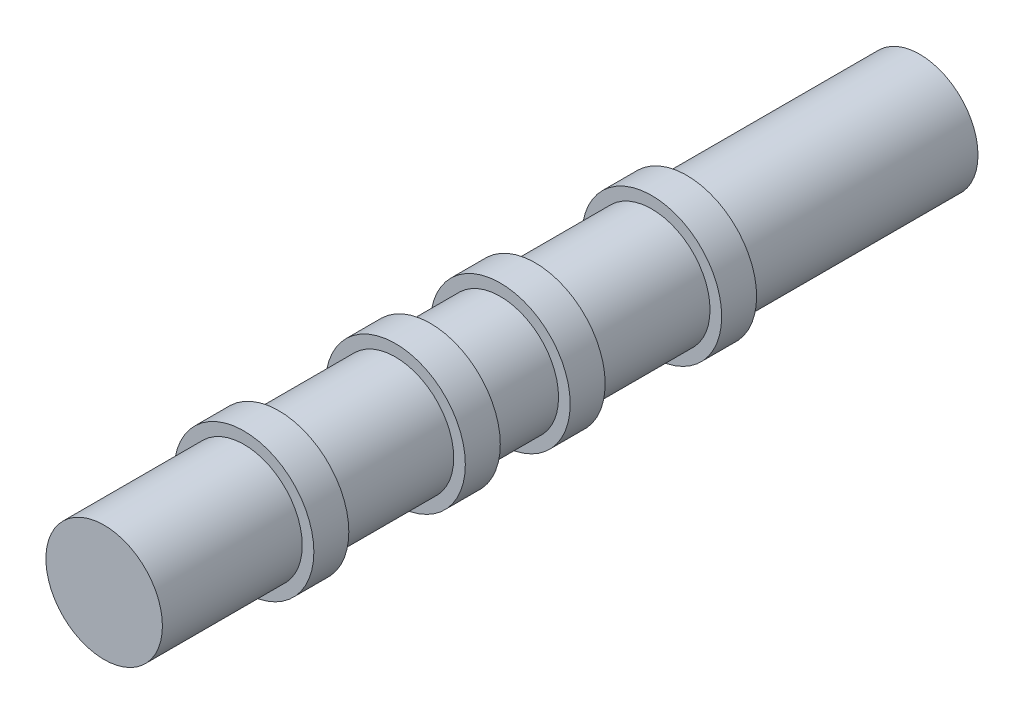
ISO-10303-21;
HEADER;
FILE_DESCRIPTION(('STEP AP214'),'2;1');
FILE_NAME('part.step','',(''),(''),'','','');
FILE_SCHEMA(('AUTOMOTIVE_DESIGN { 1 0 10303 214 1 1 1 1 }'));
ENDSEC;
DATA;
#1=APPLICATION_CONTEXT('core data for automotive mechanical design processes');
#2=APPLICATION_PROTOCOL_DEFINITION('international standard','automotive_design',2000,#1);
#3=PRODUCT_CONTEXT('',#1,'mechanical');
#4=PRODUCT('Part','Part','',(#3));
#5=PRODUCT_RELATED_PRODUCT_CATEGORY('part','',(#4));
#6=PRODUCT_DEFINITION_FORMATION('','',#4);
#7=PRODUCT_DEFINITION_CONTEXT('part definition',#1,'design');
#8=PRODUCT_DEFINITION('design','',#6,#7);
#9=PRODUCT_DEFINITION_SHAPE('','',#8);
#10=(LENGTH_UNIT() NAMED_UNIT(*) SI_UNIT(.MILLI.,.METRE.));
#11=(NAMED_UNIT(*) PLANE_ANGLE_UNIT() SI_UNIT($,.RADIAN.));
#12=(NAMED_UNIT(*) SI_UNIT($,.STERADIAN.) SOLID_ANGLE_UNIT());
#13=UNCERTAINTY_MEASURE_WITH_UNIT(LENGTH_MEASURE(1.E-05),#10,'distance_accuracy_value','');
#14=(GEOMETRIC_REPRESENTATION_CONTEXT(3) GLOBAL_UNCERTAINTY_ASSIGNED_CONTEXT((#13)) GLOBAL_UNIT_ASSIGNED_CONTEXT((#10,
#11,#12)) REPRESENTATION_CONTEXT('',''));
#15=CARTESIAN_POINT('',(0.,0.,0.));
#16=DIRECTION('',(0.,0.,1.));
#17=DIRECTION('',(1.,0.,0.));
#18=AXIS2_PLACEMENT_3D('',#15,#16,#17);
#19=CARTESIAN_POINT('',(0.,0.,20.));
#20=DIRECTION('',(0.,0.,-1.));
#21=DIRECTION('',(-1.,0.,0.));
#22=AXIS2_PLACEMENT_3D('',#19,#20,#21);
#23=CYLINDRICAL_SURFACE('',#22,5.);
#24=CARTESIAN_POINT('',(0.,0.,20.));
#25=DIRECTION('',(0.,0.,1.));
#26=DIRECTION('',(1.,0.,0.));
#27=AXIS2_PLACEMENT_3D('',#24,#25,#26);
#28=CIRCLE('',#27,5.);
#29=CARTESIAN_POINT('',(5.,0.,20.));
#30=VERTEX_POINT('',#29);
#31=EDGE_CURVE('E87',#30,#30,#28,.T.);
#32=ORIENTED_EDGE('',*,*,#31,.F.);
#33=EDGE_LOOP('',(#32));
#34=FACE_BOUND('',#33,.T.);
#35=CARTESIAN_POINT('',(0.,0.,0.));
#36=DIRECTION('',(0.,0.,1.));
#37=DIRECTION('',(1.,0.,0.));
#38=AXIS2_PLACEMENT_3D('',#35,#36,#37);
#39=CIRCLE('',#38,5.);
#40=CARTESIAN_POINT('',(5.,0.,0.));
#41=VERTEX_POINT('',#40);
#42=EDGE_CURVE('E40',#41,#41,#39,.T.);
#43=ORIENTED_EDGE('',*,*,#42,.T.);
#44=EDGE_LOOP('',(#43));
#45=FACE_BOUND('',#44,.T.);
#46=ADVANCED_FACE('F37',(#34,#45),#23,.T.);
#47=CARTESIAN_POINT('',(0.,0.,0.));
#48=DIRECTION('',(0.,0.,1.));
#49=DIRECTION('',(1.,0.,0.));
#50=AXIS2_PLACEMENT_3D('',#47,#48,#49);
#51=PLANE('',#50);
#52=ORIENTED_EDGE('',*,*,#42,.F.);
#53=EDGE_LOOP('',(#52));
#54=FACE_BOUND('',#53,.T.);
#55=ADVANCED_FACE('F99',(#54),#51,.F.);
#56=CARTESIAN_POINT('',(0.,0.,23.));
#57=DIRECTION('',(0.,0.,-1.));
#58=DIRECTION('',(-1.,0.,0.));
#59=AXIS2_PLACEMENT_3D('',#56,#57,#58);
#60=CYLINDRICAL_SURFACE('',#59,6.);
#61=CARTESIAN_POINT('',(0.,0.,23.));
#62=DIRECTION('',(0.,0.,1.));
#63=DIRECTION('',(1.,0.,0.));
#64=AXIS2_PLACEMENT_3D('',#61,#62,#63);
#65=CIRCLE('',#64,6.);
#66=CARTESIAN_POINT('',(6.,0.,23.));
#67=VERTEX_POINT('',#66);
#68=EDGE_CURVE('E88',#67,#67,#65,.T.);
#69=ORIENTED_EDGE('',*,*,#68,.F.);
#70=EDGE_LOOP('',(#69));
#71=FACE_BOUND('',#70,.T.);
#72=CARTESIAN_POINT('',(0.,0.,20.));
#73=DIRECTION('',(0.,0.,1.));
#74=DIRECTION('',(1.,0.,0.));
#75=AXIS2_PLACEMENT_3D('',#72,#73,#74);
#76=CIRCLE('',#75,6.);
#77=CARTESIAN_POINT('',(6.,0.,20.));
#78=VERTEX_POINT('',#77);
#79=EDGE_CURVE('E84',#78,#78,#76,.T.);
#80=ORIENTED_EDGE('',*,*,#79,.T.);
#81=EDGE_LOOP('',(#80));
#82=FACE_BOUND('',#81,.T.);
#83=ADVANCED_FACE('F101',(#71,#82),#60,.T.);
#84=CARTESIAN_POINT('',(0.,0.,23.));
#85=DIRECTION('',(0.,0.,1.));
#86=DIRECTION('',(1.,0.,0.));
#87=AXIS2_PLACEMENT_3D('',#84,#85,#86);
#88=PLANE('',#87);
#89=CARTESIAN_POINT('',(0.,0.,23.));
#90=DIRECTION('',(0.,0.,1.));
#91=DIRECTION('',(1.,0.,0.));
#92=AXIS2_PLACEMENT_3D('',#89,#90,#91);
#93=CIRCLE('',#92,5.);
#94=CARTESIAN_POINT('',(5.,0.,23.));
#95=VERTEX_POINT('',#94);
#96=EDGE_CURVE('E75',#95,#95,#93,.T.);
#97=ORIENTED_EDGE('',*,*,#96,.F.);
#98=EDGE_LOOP('',(#97));
#99=FACE_BOUND('',#98,.T.);
#100=ORIENTED_EDGE('',*,*,#68,.T.);
#101=EDGE_LOOP('',(#100));
#102=FACE_BOUND('',#101,.T.);
#103=ADVANCED_FACE('F106',(#99,#102),#88,.T.);
#104=CARTESIAN_POINT('',(0.,0.,20.));
#105=DIRECTION('',(0.,0.,1.));
#106=DIRECTION('',(1.,0.,0.));
#107=AXIS2_PLACEMENT_3D('',#104,#105,#106);
#108=PLANE('',#107);
#109=ORIENTED_EDGE('',*,*,#31,.T.);
#110=EDGE_LOOP('',(#109));
#111=FACE_BOUND('',#110,.T.);
#112=ORIENTED_EDGE('',*,*,#79,.F.);
#113=EDGE_LOOP('',(#112));
#114=FACE_BOUND('',#113,.T.);
#115=ADVANCED_FACE('F111',(#111,#114),#108,.F.);
#116=CARTESIAN_POINT('',(0.,0.,33.));
#117=DIRECTION('',(0.,0.,-1.));
#118=DIRECTION('',(-1.,0.,0.));
#119=AXIS2_PLACEMENT_3D('',#116,#117,#118);
#120=CYLINDRICAL_SURFACE('',#119,5.);
#121=CARTESIAN_POINT('',(0.,0.,33.));
#122=DIRECTION('',(0.,0.,1.));
#123=DIRECTION('',(1.,0.,0.));
#124=AXIS2_PLACEMENT_3D('',#121,#122,#123);
#125=CIRCLE('',#124,5.);
#126=CARTESIAN_POINT('',(5.,0.,33.));
#127=VERTEX_POINT('',#126);
#128=EDGE_CURVE('E79',#127,#127,#125,.T.);
#129=ORIENTED_EDGE('',*,*,#128,.F.);
#130=EDGE_LOOP('',(#129));
#131=FACE_BOUND('',#130,.T.);
#132=ORIENTED_EDGE('',*,*,#96,.T.);
#133=EDGE_LOOP('',(#132));
#134=FACE_BOUND('',#133,.T.);
#135=ADVANCED_FACE('F114',(#131,#134),#120,.T.);
#136=CARTESIAN_POINT('',(0.,0.,36.));
#137=DIRECTION('',(0.,0.,-1.));
#138=DIRECTION('',(-1.,0.,0.));
#139=AXIS2_PLACEMENT_3D('',#136,#137,#138);
#140=CYLINDRICAL_SURFACE('',#139,6.);
#141=CARTESIAN_POINT('',(0.,0.,36.));
#142=DIRECTION('',(0.,0.,1.));
#143=DIRECTION('',(1.,0.,0.));
#144=AXIS2_PLACEMENT_3D('',#141,#142,#143);
#145=CIRCLE('',#144,6.);
#146=CARTESIAN_POINT('',(6.,0.,36.));
#147=VERTEX_POINT('',#146);
#148=EDGE_CURVE('E76',#147,#147,#145,.T.);
#149=ORIENTED_EDGE('',*,*,#148,.F.);
#150=EDGE_LOOP('',(#149));
#151=FACE_BOUND('',#150,.T.);
#152=CARTESIAN_POINT('',(0.,0.,33.));
#153=DIRECTION('',(0.,0.,1.));
#154=DIRECTION('',(1.,0.,0.));
#155=AXIS2_PLACEMENT_3D('',#152,#153,#154);
#156=CIRCLE('',#155,6.);
#157=CARTESIAN_POINT('',(6.,0.,33.));
#158=VERTEX_POINT('',#157);
#159=EDGE_CURVE('E72',#158,#158,#156,.T.);
#160=ORIENTED_EDGE('',*,*,#159,.T.);
#161=EDGE_LOOP('',(#160));
#162=FACE_BOUND('',#161,.T.);
#163=ADVANCED_FACE('F120',(#151,#162),#140,.T.);
#164=CARTESIAN_POINT('',(0.,0.,36.));
#165=DIRECTION('',(0.,0.,1.));
#166=DIRECTION('',(1.,0.,0.));
#167=AXIS2_PLACEMENT_3D('',#164,#165,#166);
#168=PLANE('',#167);
#169=CARTESIAN_POINT('',(0.,0.,36.));
#170=DIRECTION('',(0.,0.,1.));
#171=DIRECTION('',(1.,0.,0.));
#172=AXIS2_PLACEMENT_3D('',#169,#170,#171);
#173=CIRCLE('',#172,5.);
#174=CARTESIAN_POINT('',(5.,0.,36.));
#175=VERTEX_POINT('',#174);
#176=EDGE_CURVE('E49',#175,#175,#173,.T.);
#177=ORIENTED_EDGE('',*,*,#176,.F.);
#178=EDGE_LOOP('',(#177));
#179=FACE_BOUND('',#178,.T.);
#180=ORIENTED_EDGE('',*,*,#148,.T.);
#181=EDGE_LOOP('',(#180));
#182=FACE_BOUND('',#181,.T.);
#183=ADVANCED_FACE('F124',(#179,#182),#168,.T.);
#184=CARTESIAN_POINT('',(0.,0.,33.));
#185=DIRECTION('',(0.,0.,1.));
#186=DIRECTION('',(1.,0.,0.));
#187=AXIS2_PLACEMENT_3D('',#184,#185,#186);
#188=PLANE('',#187);
#189=ORIENTED_EDGE('',*,*,#128,.T.);
#190=EDGE_LOOP('',(#189));
#191=FACE_BOUND('',#190,.T.);
#192=ORIENTED_EDGE('',*,*,#159,.F.);
#193=EDGE_LOOP('',(#192));
#194=FACE_BOUND('',#193,.T.);
#195=ADVANCED_FACE('F126',(#191,#194),#188,.F.);
#196=CARTESIAN_POINT('',(0.,0.,42.));
#197=DIRECTION('',(0.,0.,-1.));
#198=DIRECTION('',(-1.,0.,0.));
#199=AXIS2_PLACEMENT_3D('',#196,#197,#198);
#200=CYLINDRICAL_SURFACE('',#199,5.);
#201=CARTESIAN_POINT('',(0.,0.,42.));
#202=DIRECTION('',(0.,0.,1.));
#203=DIRECTION('',(1.,0.,0.));
#204=AXIS2_PLACEMENT_3D('',#201,#202,#203);
#205=CIRCLE('',#204,5.);
#206=CARTESIAN_POINT('',(5.,0.,42.));
#207=VERTEX_POINT('',#206);
#208=EDGE_CURVE('E67',#207,#207,#205,.T.);
#209=ORIENTED_EDGE('',*,*,#208,.F.);
#210=EDGE_LOOP('',(#209));
#211=FACE_BOUND('',#210,.T.);
#212=ORIENTED_EDGE('',*,*,#176,.T.);
#213=EDGE_LOOP('',(#212));
#214=FACE_BOUND('',#213,.T.);
#215=ADVANCED_FACE('F129',(#211,#214),#200,.T.);
#216=CARTESIAN_POINT('',(0.,0.,45.));
#217=DIRECTION('',(0.,0.,-1.));
#218=DIRECTION('',(-1.,0.,0.));
#219=AXIS2_PLACEMENT_3D('',#216,#217,#218);
#220=CYLINDRICAL_SURFACE('',#219,6.);
#221=CARTESIAN_POINT('',(0.,0.,45.));
#222=DIRECTION('',(0.,0.,1.));
#223=DIRECTION('',(1.,0.,0.));
#224=AXIS2_PLACEMENT_3D('',#221,#222,#223);
#225=CIRCLE('',#224,6.);
#226=CARTESIAN_POINT('',(6.,0.,45.));
#227=VERTEX_POINT('',#226);
#228=EDGE_CURVE('E64',#227,#227,#225,.T.);
#229=ORIENTED_EDGE('',*,*,#228,.F.);
#230=EDGE_LOOP('',(#229));
#231=FACE_BOUND('',#230,.T.);
#232=CARTESIAN_POINT('',(0.,0.,42.));
#233=DIRECTION('',(0.,0.,1.));
#234=DIRECTION('',(1.,0.,0.));
#235=AXIS2_PLACEMENT_3D('',#232,#233,#234);
#236=CIRCLE('',#235,6.);
#237=CARTESIAN_POINT('',(6.,0.,42.));
#238=VERTEX_POINT('',#237);
#239=EDGE_CURVE('E62',#238,#238,#236,.T.);
#240=ORIENTED_EDGE('',*,*,#239,.T.);
#241=EDGE_LOOP('',(#240));
#242=FACE_BOUND('',#241,.T.);
#243=ADVANCED_FACE('F136',(#231,#242),#220,.T.);
#244=CARTESIAN_POINT('',(0.,0.,45.));
#245=DIRECTION('',(0.,0.,1.));
#246=DIRECTION('',(1.,0.,0.));
#247=AXIS2_PLACEMENT_3D('',#244,#245,#246);
#248=PLANE('',#247);
#249=CARTESIAN_POINT('',(0.,0.,45.));
#250=DIRECTION('',(0.,0.,1.));
#251=DIRECTION('',(1.,0.,0.));
#252=AXIS2_PLACEMENT_3D('',#249,#250,#251);
#253=CIRCLE('',#252,5.);
#254=CARTESIAN_POINT('',(5.,0.,45.));
#255=VERTEX_POINT('',#254);
#256=EDGE_CURVE('E44',#255,#255,#253,.T.);
#257=ORIENTED_EDGE('',*,*,#256,.F.);
#258=EDGE_LOOP('',(#257));
#259=FACE_BOUND('',#258,.T.);
#260=ORIENTED_EDGE('',*,*,#228,.T.);
#261=EDGE_LOOP('',(#260));
#262=FACE_BOUND('',#261,.T.);
#263=ADVANCED_FACE('F140',(#259,#262),#248,.T.);
#264=CARTESIAN_POINT('',(0.,0.,42.));
#265=DIRECTION('',(0.,0.,1.));
#266=DIRECTION('',(1.,0.,0.));
#267=AXIS2_PLACEMENT_3D('',#264,#265,#266);
#268=PLANE('',#267);
#269=ORIENTED_EDGE('',*,*,#208,.T.);
#270=EDGE_LOOP('',(#269));
#271=FACE_BOUND('',#270,.T.);
#272=ORIENTED_EDGE('',*,*,#239,.F.);
#273=EDGE_LOOP('',(#272));
#274=FACE_BOUND('',#273,.T.);
#275=ADVANCED_FACE('F142',(#271,#274),#268,.F.);
#276=CARTESIAN_POINT('',(0.,0.,55.));
#277=DIRECTION('',(0.,0.,-1.));
#278=DIRECTION('',(-1.,0.,0.));
#279=AXIS2_PLACEMENT_3D('',#276,#277,#278);
#280=CYLINDRICAL_SURFACE('',#279,5.);
#281=CARTESIAN_POINT('',(0.,0.,55.));
#282=DIRECTION('',(0.,0.,1.));
#283=DIRECTION('',(1.,0.,0.));
#284=AXIS2_PLACEMENT_3D('',#281,#282,#283);
#285=CIRCLE('',#284,5.);
#286=CARTESIAN_POINT('',(5.,0.,55.));
#287=VERTEX_POINT('',#286);
#288=EDGE_CURVE('E57',#287,#287,#285,.T.);
#289=ORIENTED_EDGE('',*,*,#288,.F.);
#290=EDGE_LOOP('',(#289));
#291=FACE_BOUND('',#290,.T.);
#292=ORIENTED_EDGE('',*,*,#256,.T.);
#293=EDGE_LOOP('',(#292));
#294=FACE_BOUND('',#293,.T.);
#295=ADVANCED_FACE('F145',(#291,#294),#280,.T.);
#296=CARTESIAN_POINT('',(0.,0.,58.));
#297=DIRECTION('',(0.,0.,-1.));
#298=DIRECTION('',(-1.,0.,0.));
#299=AXIS2_PLACEMENT_3D('',#296,#297,#298);
#300=CYLINDRICAL_SURFACE('',#299,6.);
#301=CARTESIAN_POINT('',(0.,0.,58.));
#302=DIRECTION('',(0.,0.,1.));
#303=DIRECTION('',(1.,0.,0.));
#304=AXIS2_PLACEMENT_3D('',#301,#302,#303);
#305=CIRCLE('',#304,6.);
#306=CARTESIAN_POINT('',(6.,0.,58.));
#307=VERTEX_POINT('',#306);
#308=EDGE_CURVE('E54',#307,#307,#305,.T.);
#309=ORIENTED_EDGE('',*,*,#308,.F.);
#310=EDGE_LOOP('',(#309));
#311=FACE_BOUND('',#310,.T.);
#312=CARTESIAN_POINT('',(0.,0.,55.));
#313=DIRECTION('',(0.,0.,1.));
#314=DIRECTION('',(1.,0.,0.));
#315=AXIS2_PLACEMENT_3D('',#312,#313,#314);
#316=CIRCLE('',#315,6.);
#317=CARTESIAN_POINT('',(6.,0.,55.));
#318=VERTEX_POINT('',#317);
#319=EDGE_CURVE('E58',#318,#318,#316,.T.);
#320=ORIENTED_EDGE('',*,*,#319,.T.);
#321=EDGE_LOOP('',(#320));
#322=FACE_BOUND('',#321,.T.);
#323=ADVANCED_FACE('F152',(#311,#322),#300,.T.);
#324=CARTESIAN_POINT('',(0.,0.,58.));
#325=DIRECTION('',(0.,0.,1.));
#326=DIRECTION('',(1.,0.,0.));
#327=AXIS2_PLACEMENT_3D('',#324,#325,#326);
#328=PLANE('',#327);
#329=CARTESIAN_POINT('',(0.,0.,58.));
#330=DIRECTION('',(0.,0.,1.));
#331=DIRECTION('',(1.,0.,0.));
#332=AXIS2_PLACEMENT_3D('',#329,#330,#331);
#333=CIRCLE('',#332,5.);
#334=CARTESIAN_POINT('',(5.,0.,58.));
#335=VERTEX_POINT('',#334);
#336=EDGE_CURVE('E10',#335,#335,#333,.T.);
#337=ORIENTED_EDGE('',*,*,#336,.F.);
#338=EDGE_LOOP('',(#337));
#339=FACE_BOUND('',#338,.T.);
#340=ORIENTED_EDGE('',*,*,#308,.T.);
#341=EDGE_LOOP('',(#340));
#342=FACE_BOUND('',#341,.T.);
#343=ADVANCED_FACE('F156',(#339,#342),#328,.T.);
#344=CARTESIAN_POINT('',(0.,0.,55.));
#345=DIRECTION('',(0.,0.,1.));
#346=DIRECTION('',(1.,0.,0.));
#347=AXIS2_PLACEMENT_3D('',#344,#345,#346);
#348=PLANE('',#347);
#349=ORIENTED_EDGE('',*,*,#288,.T.);
#350=EDGE_LOOP('',(#349));
#351=FACE_BOUND('',#350,.T.);
#352=ORIENTED_EDGE('',*,*,#319,.F.);
#353=EDGE_LOOP('',(#352));
#354=FACE_BOUND('',#353,.T.);
#355=ADVANCED_FACE('F158',(#351,#354),#348,.F.);
#356=CARTESIAN_POINT('',(0.,0.,70.));
#357=DIRECTION('',(0.,0.,-1.));
#358=DIRECTION('',(-1.,0.,0.));
#359=AXIS2_PLACEMENT_3D('',#356,#357,#358);
#360=CYLINDRICAL_SURFACE('',#359,5.);
#361=CARTESIAN_POINT('',(0.,0.,70.));
#362=DIRECTION('',(0.,0.,1.));
#363=DIRECTION('',(1.,0.,0.));
#364=AXIS2_PLACEMENT_3D('',#361,#362,#363);
#365=CIRCLE('',#364,5.);
#366=CARTESIAN_POINT('',(5.,0.,70.));
#367=VERTEX_POINT('',#366);
#368=EDGE_CURVE('E53',#367,#367,#365,.T.);
#369=ORIENTED_EDGE('',*,*,#368,.F.);
#370=EDGE_LOOP('',(#369));
#371=FACE_BOUND('',#370,.T.);
#372=ORIENTED_EDGE('',*,*,#336,.T.);
#373=EDGE_LOOP('',(#372));
#374=FACE_BOUND('',#373,.T.);
#375=ADVANCED_FACE('F161',(#371,#374),#360,.T.);
#376=CARTESIAN_POINT('',(0.,0.,70.));
#377=DIRECTION('',(0.,0.,1.));
#378=DIRECTION('',(1.,0.,0.));
#379=AXIS2_PLACEMENT_3D('',#376,#377,#378);
#380=PLANE('',#379);
#381=ORIENTED_EDGE('',*,*,#368,.T.);
#382=EDGE_LOOP('',(#381));
#383=FACE_BOUND('',#382,.T.);
#384=ADVANCED_FACE('F168',(#383),#380,.T.);
#385=CLOSED_SHELL('',(#46,#55,#83,#103,#115,#135,#163,#183,#195,#215,#243,#263,#275,#295,#323,
#343,#355,#375,#384));
#386=MANIFOLD_SOLID_BREP('B2',#385);
#387=ADVANCED_BREP_SHAPE_REPRESENTATION('',(#18,#386),#14);
#388=SHAPE_DEFINITION_REPRESENTATION(#9,#387);
ENDSEC;
END-ISO-10303-21;
